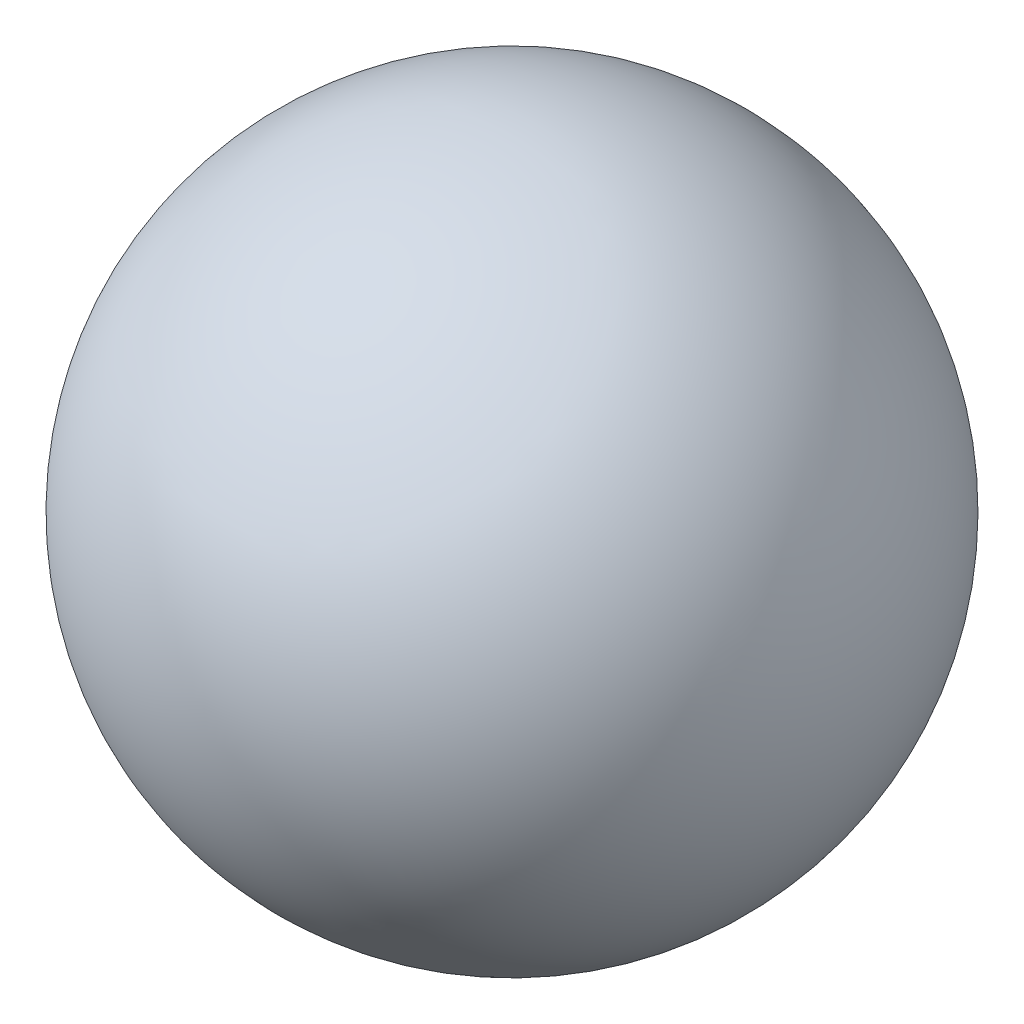
ISO-10303-21;
HEADER;
FILE_DESCRIPTION(('STEP AP214'),'2;1');
FILE_NAME('part.step','',(''),(''),'','','');
FILE_SCHEMA(('AUTOMOTIVE_DESIGN { 1 0 10303 214 1 1 1 1 }'));
ENDSEC;
DATA;
#1=APPLICATION_CONTEXT('core data for automotive mechanical design processes');
#2=APPLICATION_PROTOCOL_DEFINITION('international standard','automotive_design',2000,#1);
#3=PRODUCT_CONTEXT('',#1,'mechanical');
#4=PRODUCT('Part','Part','',(#3));
#5=PRODUCT_RELATED_PRODUCT_CATEGORY('part','',(#4));
#6=PRODUCT_DEFINITION_FORMATION('','',#4);
#7=PRODUCT_DEFINITION_CONTEXT('part definition',#1,'design');
#8=PRODUCT_DEFINITION('design','',#6,#7);
#9=PRODUCT_DEFINITION_SHAPE('','',#8);
#10=(LENGTH_UNIT() NAMED_UNIT(*) SI_UNIT(.MILLI.,.METRE.));
#11=(NAMED_UNIT(*) PLANE_ANGLE_UNIT() SI_UNIT($,.RADIAN.));
#12=(NAMED_UNIT(*) SI_UNIT($,.STERADIAN.) SOLID_ANGLE_UNIT());
#13=UNCERTAINTY_MEASURE_WITH_UNIT(LENGTH_MEASURE(1.E-05),#10,'distance_accuracy_value','');
#14=(GEOMETRIC_REPRESENTATION_CONTEXT(3) GLOBAL_UNCERTAINTY_ASSIGNED_CONTEXT((#13)) GLOBAL_UNIT_ASSIGNED_CONTEXT((#10,
#11,#12)) REPRESENTATION_CONTEXT('',''));
#15=CARTESIAN_POINT('',(0.,0.,0.));
#16=DIRECTION('',(0.,0.,1.));
#17=DIRECTION('',(1.,0.,0.));
#18=AXIS2_PLACEMENT_3D('',#15,#16,#17);
#19=CARTESIAN_POINT('',(64.16,-28.1965571573831,63.3952273713915));
#20=DIRECTION('',(0.,-0.406389996935606,0.91369971565645));
#21=DIRECTION('',(0.173648177666934,-0.899818563903522,-0.400216019728792));
#22=AXIS2_PLACEMENT_3D('',#19,#20,#21);
#23=SPHERICAL_SURFACE('',#22,7.15);
#24=CARTESIAN_POINT('',(64.16,-31.1022456354727,69.9281803383351));
#25=VERTEX_POINT('',#24);
#26=VERTEX_LOOP('',#25);
#27=FACE_BOUND('',#26,.T.);
#28=CARTESIAN_POINT('',(64.16,-25.2908686792935,56.8622744044479));
#29=VERTEX_POINT('',#28);
#30=VERTEX_LOOP('',#29);
#31=FACE_BOUND('',#30,.T.);
#32=ADVANCED_FACE('F16',(#27,#31),#23,.T.);
#33=CLOSED_SHELL('',(#32));
#34=MANIFOLD_SOLID_BREP('B1',#33);
#35=ADVANCED_BREP_SHAPE_REPRESENTATION('',(#18,#34),#14);
#36=SHAPE_DEFINITION_REPRESENTATION(#9,#35);
ENDSEC;
END-ISO-10303-21;
